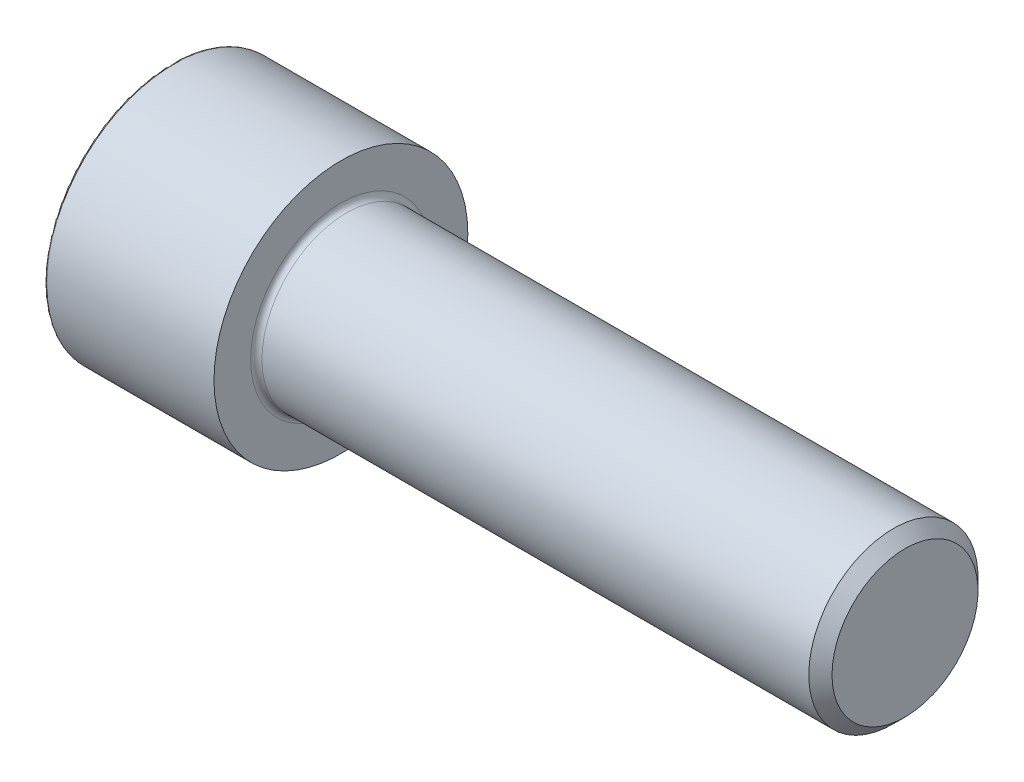
ISO-10303-21;
HEADER;
FILE_DESCRIPTION(('STEP AP214'),'2;1');
FILE_NAME('part.step','',(''),(''),'','','');
FILE_SCHEMA(('AUTOMOTIVE_DESIGN { 1 0 10303 214 1 1 1 1 }'));
ENDSEC;
DATA;
#1=APPLICATION_CONTEXT('core data for automotive mechanical design processes');
#2=APPLICATION_PROTOCOL_DEFINITION('international standard','automotive_design',2000,#1);
#3=PRODUCT_CONTEXT('',#1,'mechanical');
#4=PRODUCT('Part','Part','',(#3));
#5=PRODUCT_RELATED_PRODUCT_CATEGORY('part','',(#4));
#6=PRODUCT_DEFINITION_FORMATION('','',#4);
#7=PRODUCT_DEFINITION_CONTEXT('part definition',#1,'design');
#8=PRODUCT_DEFINITION('design','',#6,#7);
#9=PRODUCT_DEFINITION_SHAPE('','',#8);
#10=(LENGTH_UNIT() NAMED_UNIT(*) SI_UNIT(.MILLI.,.METRE.));
#11=(NAMED_UNIT(*) PLANE_ANGLE_UNIT() SI_UNIT($,.RADIAN.));
#12=(NAMED_UNIT(*) SI_UNIT($,.STERADIAN.) SOLID_ANGLE_UNIT());
#13=UNCERTAINTY_MEASURE_WITH_UNIT(LENGTH_MEASURE(1.E-05),#10,'distance_accuracy_value','');
#14=(GEOMETRIC_REPRESENTATION_CONTEXT(3) GLOBAL_UNCERTAINTY_ASSIGNED_CONTEXT((#13)) GLOBAL_UNIT_ASSIGNED_CONTEXT((#10,
#11,#12)) REPRESENTATION_CONTEXT('',''));
#15=CARTESIAN_POINT('',(0.,0.,0.));
#16=DIRECTION('',(0.,0.,1.));
#17=DIRECTION('',(1.,0.,0.));
#18=AXIS2_PLACEMENT_3D('',#15,#16,#17);
#19=CARTESIAN_POINT('',(0.,0.,0.));
#20=DIRECTION('',(-1.,0.,0.));
#21=DIRECTION('',(0.,0.,1.));
#22=AXIS2_PLACEMENT_3D('',#19,#20,#21);
#23=PLANE('',#22);
#24=DIRECTION('',(0.,-0.499999999999999,0.866025403784439));
#25=VECTOR('',#24,1.);
#26=CARTESIAN_POINT('',(0.,11.12842643863,0.));
#27=LINE('',#26,#25);
#28=CARTESIAN_POINT('',(0.,11.12842643863,0.));
#29=VERTEX_POINT('',#28);
#30=CARTESIAN_POINT('',(0.,5.56421321931504,9.63749999999999));
#31=VERTEX_POINT('',#30);
#32=EDGE_CURVE('E394',#29,#31,#27,.T.);
#33=ORIENTED_EDGE('',*,*,#32,.T.);
#34=DIRECTION('',(0.,1.,0.));
#35=VECTOR('',#34,1.);
#36=CARTESIAN_POINT('',(0.,-5.56421321931499,9.6375));
#37=LINE('',#36,#35);
#38=CARTESIAN_POINT('',(0.,-5.56421321931499,9.6375));
#39=VERTEX_POINT('',#38);
#40=EDGE_CURVE('E143',#39,#31,#37,.T.);
#41=ORIENTED_EDGE('',*,*,#40,.F.);
#42=DIRECTION('',(0.,-0.500000000000001,-0.866025403784438));
#43=VECTOR('',#42,1.);
#44=CARTESIAN_POINT('',(0.,-5.56421321931499,9.6375));
#45=LINE('',#44,#43);
#46=CARTESIAN_POINT('',(0.,-11.12842643863,0.));
#47=VERTEX_POINT('',#46);
#48=EDGE_CURVE('E397',#39,#47,#45,.T.);
#49=ORIENTED_EDGE('',*,*,#48,.T.);
#50=DIRECTION('',(0.,0.499999999999998,-0.86602540378444));
#51=VECTOR('',#50,1.);
#52=CARTESIAN_POINT('',(0.,-11.12842643863,0.));
#53=LINE('',#52,#51);
#54=CARTESIAN_POINT('',(0.,-5.56421321931502,-9.63749999999999));
#55=VERTEX_POINT('',#54);
#56=EDGE_CURVE('E400',#47,#55,#53,.T.);
#57=ORIENTED_EDGE('',*,*,#56,.T.);
#58=DIRECTION('',(0.,-1.,0.));
#59=VECTOR('',#58,1.);
#60=CARTESIAN_POINT('',(0.,5.56421321931501,-9.6375));
#61=LINE('',#60,#59);
#62=CARTESIAN_POINT('',(0.,5.56421321931501,-9.6375));
#63=VERTEX_POINT('',#62);
#64=EDGE_CURVE('E403',#63,#55,#61,.T.);
#65=ORIENTED_EDGE('',*,*,#64,.F.);
#66=DIRECTION('',(0.,-0.500000000000001,-0.866025403784438));
#67=VECTOR('',#66,1.);
#68=CARTESIAN_POINT('',(0.,11.12842643863,0.));
#69=LINE('',#68,#67);
#70=EDGE_CURVE('E138',#29,#63,#69,.T.);
#71=ORIENTED_EDGE('',*,*,#70,.F.);
#72=EDGE_LOOP('',(#33,#41,#49,#57,#65,#71));
#73=FACE_BOUND('',#72,.T.);
#74=CARTESIAN_POINT('',(0.,0.,0.));
#75=DIRECTION('',(-1.,0.,0.));
#76=DIRECTION('',(0.,0.,1.));
#77=AXIS2_PLACEMENT_3D('',#74,#75,#76);
#78=CIRCLE('',#77,17.7);
#79=CARTESIAN_POINT('',(0.,0.,17.7));
#80=VERTEX_POINT('',#79);
#81=EDGE_CURVE('E55',#80,#80,#78,.T.);
#82=ORIENTED_EDGE('',*,*,#81,.T.);
#83=EDGE_LOOP('',(#82));
#84=FACE_BOUND('',#83,.T.);
#85=ADVANCED_FACE('F47',(#73,#84),#23,.T.);
#86=CARTESIAN_POINT('',(104.,10.352,0.));
#87=DIRECTION('',(1.,0.,0.));
#88=DIRECTION('',(0.,0.,-1.));
#89=AXIS2_PLACEMENT_3D('',#86,#87,#88);
#90=PLANE('',#89);
#91=CARTESIAN_POINT('',(104.,0.,0.));
#92=DIRECTION('',(-1.,0.,0.));
#93=DIRECTION('',(0.,0.,1.));
#94=AXIS2_PLACEMENT_3D('',#91,#92,#93);
#95=CIRCLE('',#94,10.352);
#96=CARTESIAN_POINT('',(104.,0.,10.352));
#97=VERTEX_POINT('',#96);
#98=EDGE_CURVE('E161',#97,#97,#95,.T.);
#99=ORIENTED_EDGE('',*,*,#98,.F.);
#100=EDGE_LOOP('',(#99));
#101=FACE_BOUND('',#100,.T.);
#102=ADVANCED_FACE('F186',(#101),#90,.T.);
#103=CARTESIAN_POINT('',(104.,0.,0.));
#104=DIRECTION('',(-1.,0.,0.));
#105=DIRECTION('',(0.,0.,1.));
#106=AXIS2_PLACEMENT_3D('',#103,#104,#105);
#107=CONICAL_SURFACE('',#106,10.352,0.785398163397453);
#108=CARTESIAN_POINT('',(102.352,0.,0.));
#109=DIRECTION('',(-1.,0.,0.));
#110=DIRECTION('',(0.,0.,1.));
#111=AXIS2_PLACEMENT_3D('',#108,#109,#110);
#112=CIRCLE('',#111,12.);
#113=CARTESIAN_POINT('',(102.352,0.,12.));
#114=VERTEX_POINT('',#113);
#115=EDGE_CURVE('E158',#114,#114,#112,.T.);
#116=ORIENTED_EDGE('',*,*,#115,.F.);
#117=EDGE_LOOP('',(#116));
#118=FACE_BOUND('',#117,.T.);
#119=ORIENTED_EDGE('',*,*,#98,.T.);
#120=EDGE_LOOP('',(#119));
#121=FACE_BOUND('',#120,.T.);
#122=ADVANCED_FACE('F192',(#118,#121),#107,.T.);
#123=CARTESIAN_POINT('',(-31.75,0.,0.));
#124=DIRECTION('',(-1.,0.,0.));
#125=DIRECTION('',(0.,0.,1.));
#126=AXIS2_PLACEMENT_3D('',#123,#124,#125);
#127=CYLINDRICAL_SURFACE('',#126,12.);
#128=CARTESIAN_POINT('',(24.8,0.,0.));
#129=DIRECTION('',(1.,0.,0.));
#130=DIRECTION('',(0.,0.,-1.));
#131=AXIS2_PLACEMENT_3D('',#128,#129,#130);
#132=CIRCLE('',#131,12.);
#133=CARTESIAN_POINT('',(24.8,0.,-12.));
#134=VERTEX_POINT('',#133);
#135=EDGE_CURVE('E167',#134,#134,#132,.T.);
#136=ORIENTED_EDGE('',*,*,#135,.T.);
#137=EDGE_LOOP('',(#136));
#138=FACE_BOUND('',#137,.T.);
#139=ORIENTED_EDGE('',*,*,#115,.T.);
#140=EDGE_LOOP('',(#139));
#141=FACE_BOUND('',#140,.T.);
#142=ADVANCED_FACE('F203',(#138,#141),#127,.T.);
#143=CARTESIAN_POINT('',(24.,18.,0.));
#144=DIRECTION('',(1.,0.,0.));
#145=DIRECTION('',(0.,0.,-1.));
#146=AXIS2_PLACEMENT_3D('',#143,#144,#145);
#147=PLANE('',#146);
#148=CARTESIAN_POINT('',(24.,0.,0.));
#149=DIRECTION('',(1.,0.,0.));
#150=DIRECTION('',(0.,0.,-1.));
#151=AXIS2_PLACEMENT_3D('',#148,#149,#150);
#152=CIRCLE('',#151,12.8);
#153=CARTESIAN_POINT('',(24.,0.,-12.8));
#154=VERTEX_POINT('',#153);
#155=EDGE_CURVE('E164',#154,#154,#152,.F.);
#156=ORIENTED_EDGE('',*,*,#155,.T.);
#157=EDGE_LOOP('',(#156));
#158=FACE_BOUND('',#157,.T.);
#159=CARTESIAN_POINT('',(24.,0.,0.));
#160=DIRECTION('',(-1.,0.,0.));
#161=DIRECTION('',(0.,0.,1.));
#162=AXIS2_PLACEMENT_3D('',#159,#160,#161);
#163=CIRCLE('',#162,18.);
#164=CARTESIAN_POINT('',(24.,0.,18.));
#165=VERTEX_POINT('',#164);
#166=EDGE_CURVE('E154',#165,#165,#163,.T.);
#167=ORIENTED_EDGE('',*,*,#166,.F.);
#168=EDGE_LOOP('',(#167));
#169=FACE_BOUND('',#168,.T.);
#170=ADVANCED_FACE('F199',(#158,#169),#147,.T.);
#171=CARTESIAN_POINT('',(-31.75,0.,0.));
#172=DIRECTION('',(-1.,0.,0.));
#173=DIRECTION('',(0.,0.,1.));
#174=AXIS2_PLACEMENT_3D('',#171,#172,#173);
#175=CYLINDRICAL_SURFACE('',#174,18.);
#176=CARTESIAN_POINT('',(0.300000000000002,0.,0.));
#177=DIRECTION('',(-1.,0.,0.));
#178=DIRECTION('',(0.,0.,1.));
#179=AXIS2_PLACEMENT_3D('',#176,#177,#178);
#180=CIRCLE('',#179,18.);
#181=CARTESIAN_POINT('',(0.300000000000002,0.,18.));
#182=VERTEX_POINT('',#181);
#183=EDGE_CURVE('E11',#182,#182,#180,.F.);
#184=ORIENTED_EDGE('',*,*,#183,.T.);
#185=EDGE_LOOP('',(#184));
#186=FACE_BOUND('',#185,.T.);
#187=ORIENTED_EDGE('',*,*,#166,.T.);
#188=EDGE_LOOP('',(#187));
#189=FACE_BOUND('',#188,.T.);
#190=ADVANCED_FACE('F183',(#186,#189),#175,.T.);
#191=CARTESIAN_POINT('',(24.8,0.,0.));
#192=DIRECTION('',(1.,0.,0.));
#193=DIRECTION('',(0.,0.,-1.));
#194=AXIS2_PLACEMENT_3D('',#191,#192,#193);
#195=TOROIDAL_SURFACE('',#194,12.8,0.8);
#196=ORIENTED_EDGE('',*,*,#135,.F.);
#197=EDGE_LOOP('',(#196));
#198=FACE_BOUND('',#197,.T.);
#199=ORIENTED_EDGE('',*,*,#155,.F.);
#200=EDGE_LOOP('',(#199));
#201=FACE_BOUND('',#200,.T.);
#202=ADVANCED_FACE('F174',(#198,#201),#195,.F.);
#203=CARTESIAN_POINT('',(0.300000000000002,0.,0.));
#204=DIRECTION('',(-1.,0.,0.));
#205=DIRECTION('',(0.,0.,1.));
#206=AXIS2_PLACEMENT_3D('',#203,#204,#205);
#207=TOROIDAL_SURFACE('',#206,17.7,0.3);
#208=ORIENTED_EDGE('',*,*,#183,.F.);
#209=EDGE_LOOP('',(#208));
#210=FACE_BOUND('',#209,.T.);
#211=ORIENTED_EDGE('',*,*,#81,.F.);
#212=EDGE_LOOP('',(#211));
#213=FACE_BOUND('',#212,.T.);
#214=ADVANCED_FACE('F49',(#210,#213),#207,.T.);
#215=CARTESIAN_POINT('',(12.573,11.12842643863,0.));
#216=DIRECTION('',(0.,-0.866025403784439,-0.499999999999999));
#217=DIRECTION('',(0.,0.499999999999999,-0.866025403784439));
#218=AXIS2_PLACEMENT_3D('',#215,#216,#217);
#219=PLANE('',#218);
#220=ORIENTED_EDGE('',*,*,#32,.F.);
#221=DIRECTION('',(-1.,0.,0.));
#222=VECTOR('',#221,1.);
#223=CARTESIAN_POINT('',(12.573,11.12842643863,0.));
#224=LINE('',#223,#222);
#225=CARTESIAN_POINT('',(12.573,11.12842643863,0.));
#226=VERTEX_POINT('',#225);
#227=EDGE_CURVE('E384',#226,#29,#224,.T.);
#228=ORIENTED_EDGE('',*,*,#227,.F.);
#229=DIRECTION('',(0.,-0.499999999999999,0.866025403784439));
#230=VECTOR('',#229,1.);
#231=CARTESIAN_POINT('',(12.573,11.12842643863,0.));
#232=LINE('',#231,#230);
#233=CARTESIAN_POINT('',(12.573,8.34631982897254,4.81874999999999));
#234=VERTEX_POINT('',#233);
#235=EDGE_CURVE('E130',#226,#234,#232,.T.);
#236=ORIENTED_EDGE('',*,*,#235,.T.);
#237=CARTESIAN_POINT('',(12.573,5.56421321931504,9.63749999999999));
#238=VERTEX_POINT('',#237);
#239=EDGE_CURVE('E121',#234,#238,#232,.T.);
#240=ORIENTED_EDGE('',*,*,#239,.T.);
#241=DIRECTION('',(-1.,0.,0.));
#242=VECTOR('',#241,1.);
#243=CARTESIAN_POINT('',(12.573,5.56421321931504,9.63749999999999));
#244=LINE('',#243,#242);
#245=EDGE_CURVE('E135',#238,#31,#244,.T.);
#246=ORIENTED_EDGE('',*,*,#245,.T.);
#247=EDGE_LOOP('',(#220,#228,#236,#240,#246));
#248=FACE_BOUND('',#247,.T.);
#249=ADVANCED_FACE('F134',(#248),#219,.T.);
#250=CARTESIAN_POINT('',(12.573,-5.56421321931499,9.6375));
#251=DIRECTION('',(0.,0.,1.));
#252=DIRECTION('',(0.,-1.,0.));
#253=AXIS2_PLACEMENT_3D('',#250,#251,#252);
#254=PLANE('',#253);
#255=ORIENTED_EDGE('',*,*,#40,.T.);
#256=ORIENTED_EDGE('',*,*,#245,.F.);
#257=DIRECTION('',(0.,1.,0.));
#258=VECTOR('',#257,1.);
#259=CARTESIAN_POINT('',(12.573,-5.56421321931499,9.6375));
#260=LINE('',#259,#258);
#261=CARTESIAN_POINT('',(12.573,0.,9.6375));
#262=VERTEX_POINT('',#261);
#263=EDGE_CURVE('E118',#262,#238,#260,.T.);
#264=ORIENTED_EDGE('',*,*,#263,.F.);
#265=CARTESIAN_POINT('',(12.573,-5.56421321931499,9.6375));
#266=VERTEX_POINT('',#265);
#267=EDGE_CURVE('E129',#266,#262,#260,.T.);
#268=ORIENTED_EDGE('',*,*,#267,.F.);
#269=DIRECTION('',(-1.,0.,0.));
#270=VECTOR('',#269,1.);
#271=CARTESIAN_POINT('',(12.573,-5.56421321931499,9.6375));
#272=LINE('',#271,#270);
#273=EDGE_CURVE('E145',#266,#39,#272,.T.);
#274=ORIENTED_EDGE('',*,*,#273,.T.);
#275=EDGE_LOOP('',(#255,#256,#264,#268,#274));
#276=FACE_BOUND('',#275,.T.);
#277=ADVANCED_FACE('F140',(#276),#254,.F.);
#278=CARTESIAN_POINT('',(12.573,-5.56421321931499,9.6375));
#279=DIRECTION('',(0.,0.866025403784438,-0.500000000000001));
#280=DIRECTION('',(0.,0.500000000000001,0.866025403784438));
#281=AXIS2_PLACEMENT_3D('',#278,#279,#280);
#282=PLANE('',#281);
#283=ORIENTED_EDGE('',*,*,#48,.F.);
#284=ORIENTED_EDGE('',*,*,#273,.F.);
#285=DIRECTION('',(0.,-0.500000000000001,-0.866025403784438));
#286=VECTOR('',#285,1.);
#287=CARTESIAN_POINT('',(12.573,-5.56421321931499,9.6375));
#288=LINE('',#287,#286);
#289=CARTESIAN_POINT('',(12.573,-8.34631982897251,4.81875));
#290=VERTEX_POINT('',#289);
#291=EDGE_CURVE('E423',#266,#290,#288,.T.);
#292=ORIENTED_EDGE('',*,*,#291,.T.);
#293=CARTESIAN_POINT('',(12.573,-11.12842643863,0.));
#294=VERTEX_POINT('',#293);
#295=EDGE_CURVE('E412',#290,#294,#288,.T.);
#296=ORIENTED_EDGE('',*,*,#295,.T.);
#297=DIRECTION('',(-1.,0.,0.));
#298=VECTOR('',#297,1.);
#299=CARTESIAN_POINT('',(12.573,-11.12842643863,0.));
#300=LINE('',#299,#298);
#301=EDGE_CURVE('E150',#294,#47,#300,.T.);
#302=ORIENTED_EDGE('',*,*,#301,.T.);
#303=EDGE_LOOP('',(#283,#284,#292,#296,#302));
#304=FACE_BOUND('',#303,.T.);
#305=ADVANCED_FACE('F273',(#304),#282,.T.);
#306=CARTESIAN_POINT('',(12.573,-11.12842643863,0.));
#307=DIRECTION('',(0.,0.86602540378444,0.499999999999998));
#308=DIRECTION('',(0.,-0.499999999999998,0.86602540378444));
#309=AXIS2_PLACEMENT_3D('',#306,#307,#308);
#310=PLANE('',#309);
#311=ORIENTED_EDGE('',*,*,#56,.F.);
#312=ORIENTED_EDGE('',*,*,#301,.F.);
#313=DIRECTION('',(0.,0.499999999999998,-0.86602540378444));
#314=VECTOR('',#313,1.);
#315=CARTESIAN_POINT('',(12.573,-11.12842643863,0.));
#316=LINE('',#315,#314);
#317=CARTESIAN_POINT('',(12.573,-8.34631982897253,-4.81874999999998));
#318=VERTEX_POINT('',#317);
#319=EDGE_CURVE('E390',#294,#318,#316,.T.);
#320=ORIENTED_EDGE('',*,*,#319,.T.);
#321=CARTESIAN_POINT('',(12.573,-5.56421321931502,-9.63749999999999));
#322=VERTEX_POINT('',#321);
#323=EDGE_CURVE('E422',#318,#322,#316,.T.);
#324=ORIENTED_EDGE('',*,*,#323,.T.);
#325=DIRECTION('',(-1.,0.,0.));
#326=VECTOR('',#325,1.);
#327=CARTESIAN_POINT('',(12.573,-5.56421321931502,-9.63749999999999));
#328=LINE('',#327,#326);
#329=EDGE_CURVE('E383',#322,#55,#328,.T.);
#330=ORIENTED_EDGE('',*,*,#329,.T.);
#331=EDGE_LOOP('',(#311,#312,#320,#324,#330));
#332=FACE_BOUND('',#331,.T.);
#333=ADVANCED_FACE('F281',(#332),#310,.T.);
#334=CARTESIAN_POINT('',(12.573,5.56421321931501,-9.6375));
#335=DIRECTION('',(0.,0.,-1.));
#336=DIRECTION('',(0.,1.,0.));
#337=AXIS2_PLACEMENT_3D('',#334,#335,#336);
#338=PLANE('',#337);
#339=ORIENTED_EDGE('',*,*,#64,.T.);
#340=ORIENTED_EDGE('',*,*,#329,.F.);
#341=DIRECTION('',(0.,-1.,0.));
#342=VECTOR('',#341,1.);
#343=CARTESIAN_POINT('',(12.573,5.56421321931501,-9.6375));
#344=LINE('',#343,#342);
#345=CARTESIAN_POINT('',(12.573,0.,-9.6375));
#346=VERTEX_POINT('',#345);
#347=EDGE_CURVE('E387',#346,#322,#344,.T.);
#348=ORIENTED_EDGE('',*,*,#347,.F.);
#349=CARTESIAN_POINT('',(12.573,5.56421321931501,-9.6375));
#350=VERTEX_POINT('',#349);
#351=EDGE_CURVE('E62',#350,#346,#344,.T.);
#352=ORIENTED_EDGE('',*,*,#351,.F.);
#353=DIRECTION('',(-1.,0.,0.));
#354=VECTOR('',#353,1.);
#355=CARTESIAN_POINT('',(12.573,5.56421321931501,-9.6375));
#356=LINE('',#355,#354);
#357=EDGE_CURVE('E380',#350,#63,#356,.T.);
#358=ORIENTED_EDGE('',*,*,#357,.T.);
#359=EDGE_LOOP('',(#339,#340,#348,#352,#358));
#360=FACE_BOUND('',#359,.T.);
#361=ADVANCED_FACE('F290',(#360),#338,.F.);
#362=CARTESIAN_POINT('',(12.573,11.12842643863,0.));
#363=DIRECTION('',(0.,0.866025403784438,-0.500000000000001));
#364=DIRECTION('',(0.,0.500000000000001,0.866025403784438));
#365=AXIS2_PLACEMENT_3D('',#362,#363,#364);
#366=PLANE('',#365);
#367=ORIENTED_EDGE('',*,*,#70,.T.);
#368=ORIENTED_EDGE('',*,*,#357,.F.);
#369=DIRECTION('',(0.,-0.500000000000001,-0.866025403784438));
#370=VECTOR('',#369,1.);
#371=CARTESIAN_POINT('',(12.573,11.12842643863,0.));
#372=LINE('',#371,#370);
#373=CARTESIAN_POINT('',(12.573,8.34631982897252,-4.81875000000001));
#374=VERTEX_POINT('',#373);
#375=EDGE_CURVE('E370',#374,#350,#372,.T.);
#376=ORIENTED_EDGE('',*,*,#375,.F.);
#377=EDGE_CURVE('E376',#226,#374,#372,.T.);
#378=ORIENTED_EDGE('',*,*,#377,.F.);
#379=ORIENTED_EDGE('',*,*,#227,.T.);
#380=EDGE_LOOP('',(#367,#368,#376,#378,#379));
#381=FACE_BOUND('',#380,.T.);
#382=ADVANCED_FACE('F299',(#381),#366,.F.);
#383=CARTESIAN_POINT('',(12.573,16.692639657945,-9.63750000000002));
#384=DIRECTION('',(1.,0.,0.));
#385=DIRECTION('',(0.,0.,-1.));
#386=AXIS2_PLACEMENT_3D('',#383,#384,#385);
#387=PLANE('',#386);
#388=ORIENTED_EDGE('',*,*,#347,.T.);
#389=ORIENTED_EDGE('',*,*,#323,.F.);
#390=CARTESIAN_POINT('',(12.573,0.,0.));
#391=DIRECTION('',(-1.,0.,0.));
#392=DIRECTION('',(0.,0.,1.));
#393=AXIS2_PLACEMENT_3D('',#390,#391,#392);
#394=CIRCLE('',#393,9.6375);
#395=EDGE_CURVE('E418',#346,#318,#394,.T.);
#396=ORIENTED_EDGE('',*,*,#395,.F.);
#397=EDGE_LOOP('',(#388,#389,#396));
#398=FACE_BOUND('',#397,.T.);
#399=ADVANCED_FACE('F308',(#398),#387,.F.);
#400=ORIENTED_EDGE('',*,*,#319,.F.);
#401=ORIENTED_EDGE('',*,*,#295,.F.);
#402=EDGE_CURVE('E148',#318,#290,#394,.T.);
#403=ORIENTED_EDGE('',*,*,#402,.F.);
#404=EDGE_LOOP('',(#400,#401,#403));
#405=FACE_BOUND('',#404,.T.);
#406=ADVANCED_FACE('F317',(#405),#387,.F.);
#407=ORIENTED_EDGE('',*,*,#291,.F.);
#408=ORIENTED_EDGE('',*,*,#267,.T.);
#409=EDGE_CURVE('E144',#290,#262,#394,.T.);
#410=ORIENTED_EDGE('',*,*,#409,.F.);
#411=EDGE_LOOP('',(#407,#408,#410));
#412=FACE_BOUND('',#411,.T.);
#413=ADVANCED_FACE('F326',(#412),#387,.F.);
#414=ORIENTED_EDGE('',*,*,#263,.T.);
#415=ORIENTED_EDGE('',*,*,#239,.F.);
#416=EDGE_CURVE('E124',#262,#234,#394,.T.);
#417=ORIENTED_EDGE('',*,*,#416,.F.);
#418=EDGE_LOOP('',(#414,#415,#417));
#419=FACE_BOUND('',#418,.T.);
#420=ADVANCED_FACE('F120',(#419),#387,.F.);
#421=ORIENTED_EDGE('',*,*,#235,.F.);
#422=ORIENTED_EDGE('',*,*,#377,.T.);
#423=EDGE_CURVE('E155',#234,#374,#394,.T.);
#424=ORIENTED_EDGE('',*,*,#423,.F.);
#425=EDGE_LOOP('',(#421,#422,#424));
#426=FACE_BOUND('',#425,.T.);
#427=ADVANCED_FACE('F341',(#426),#387,.F.);
#428=ORIENTED_EDGE('',*,*,#375,.T.);
#429=ORIENTED_EDGE('',*,*,#351,.T.);
#430=EDGE_CURVE('E373',#374,#346,#394,.T.);
#431=ORIENTED_EDGE('',*,*,#430,.F.);
#432=EDGE_LOOP('',(#428,#429,#431));
#433=FACE_BOUND('',#432,.T.);
#434=ADVANCED_FACE('F256',(#433),#387,.F.);
#435=CARTESIAN_POINT('',(12.573,0.,0.));
#436=DIRECTION('',(-1.,0.,0.));
#437=DIRECTION('',(0.,0.,1.));
#438=AXIS2_PLACEMENT_3D('',#435,#436,#437);
#439=CONICAL_SURFACE('',#438,9.6375,1.04719755119659);
#440=CARTESIAN_POINT('',(18.1372132193151,0.,0.));
#441=VERTEX_POINT('',#440);
#442=VERTEX_LOOP('',#441);
#443=FACE_BOUND('',#442,.T.);
#444=ORIENTED_EDGE('',*,*,#416,.T.);
#445=ORIENTED_EDGE('',*,*,#423,.T.);
#446=ORIENTED_EDGE('',*,*,#430,.T.);
#447=ORIENTED_EDGE('',*,*,#395,.T.);
#448=ORIENTED_EDGE('',*,*,#402,.T.);
#449=ORIENTED_EDGE('',*,*,#409,.T.);
#450=EDGE_LOOP('',(#444,#445,#446,#447,#448,#449));
#451=FACE_BOUND('',#450,.T.);
#452=ADVANCED_FACE('F197',(#443,#451),#439,.F.);
#453=CLOSED_SHELL('',(#85,#102,#122,#142,#170,#190,#202,#214,#249,#277,#305,#333,#361,#382,#399,
#406,#413,#420,#427,#434,#452));
#454=MANIFOLD_SOLID_BREP('B2',#453);
#455=ADVANCED_BREP_SHAPE_REPRESENTATION('',(#18,#454),#14);
#456=SHAPE_DEFINITION_REPRESENTATION(#9,#455);
ENDSEC;
END-ISO-10303-21;
